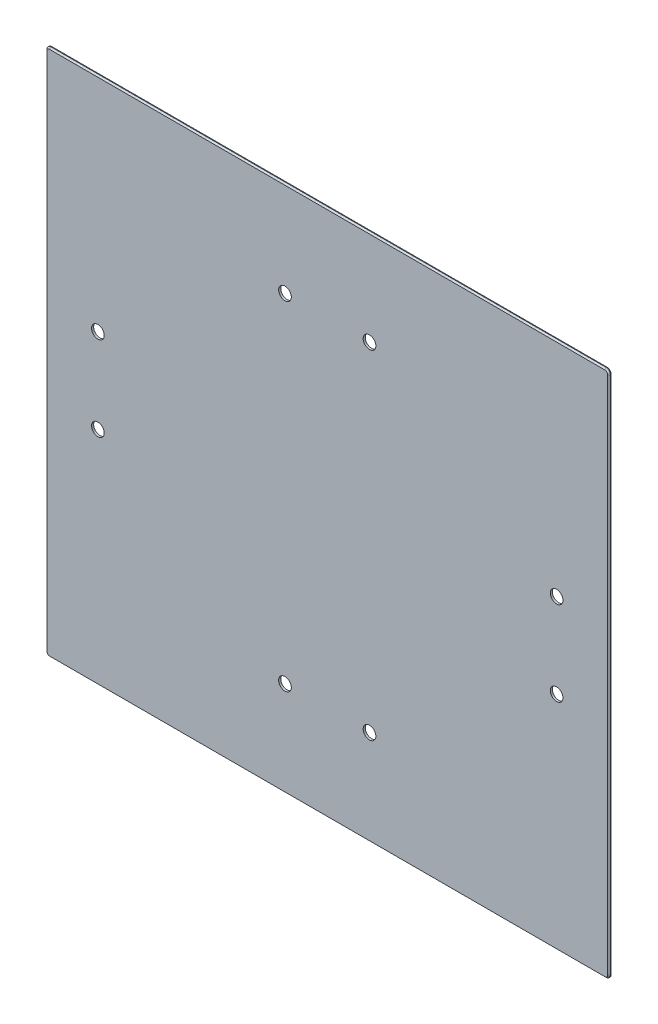
ISO-10303-21;
HEADER;
FILE_DESCRIPTION(('STEP AP214'),'2;1');
FILE_NAME('part.step','',(''),(''),'','','');
FILE_SCHEMA(('AUTOMOTIVE_DESIGN { 1 0 10303 214 1 1 1 1 }'));
ENDSEC;
DATA;
#1=APPLICATION_CONTEXT('core data for automotive mechanical design processes');
#2=APPLICATION_PROTOCOL_DEFINITION('international standard','automotive_design',2000,#1);
#3=PRODUCT_CONTEXT('',#1,'mechanical');
#4=PRODUCT('Part','Part','',(#3));
#5=PRODUCT_RELATED_PRODUCT_CATEGORY('part','',(#4));
#6=PRODUCT_DEFINITION_FORMATION('','',#4);
#7=PRODUCT_DEFINITION_CONTEXT('part definition',#1,'design');
#8=PRODUCT_DEFINITION('design','',#6,#7);
#9=PRODUCT_DEFINITION_SHAPE('','',#8);
#10=(LENGTH_UNIT() NAMED_UNIT(*) SI_UNIT(.MILLI.,.METRE.));
#11=(NAMED_UNIT(*) PLANE_ANGLE_UNIT() SI_UNIT($,.RADIAN.));
#12=(NAMED_UNIT(*) SI_UNIT($,.STERADIAN.) SOLID_ANGLE_UNIT());
#13=UNCERTAINTY_MEASURE_WITH_UNIT(LENGTH_MEASURE(1.E-05),#10,'distance_accuracy_value','');
#14=(GEOMETRIC_REPRESENTATION_CONTEXT(3) GLOBAL_UNCERTAINTY_ASSIGNED_CONTEXT((#13)) GLOBAL_UNIT_ASSIGNED_CONTEXT((#10,
#11,#12)) REPRESENTATION_CONTEXT('',''));
#15=CARTESIAN_POINT('',(0.,0.,0.));
#16=DIRECTION('',(0.,0.,1.));
#17=DIRECTION('',(1.,0.,0.));
#18=AXIS2_PLACEMENT_3D('',#15,#16,#17);
#19=CARTESIAN_POINT('',(200.,-187.5,1.5));
#20=DIRECTION('',(-1.,0.,0.));
#21=DIRECTION('',(0.,0.,1.));
#22=AXIS2_PLACEMENT_3D('',#19,#20,#21);
#23=PLANE('',#22);
#24=DIRECTION('',(0.,0.,-1.));
#25=VECTOR('',#24,1.);
#26=CARTESIAN_POINT('',(200.,184.5,1.5));
#27=LINE('',#26,#25);
#28=CARTESIAN_POINT('',(200.,184.5,0.));
#29=VERTEX_POINT('',#28);
#30=CARTESIAN_POINT('',(200.,184.5,0.500000000000055));
#31=VERTEX_POINT('',#30);
#32=EDGE_CURVE('E156',#29,#31,#27,.F.);
#33=ORIENTED_EDGE('',*,*,#32,.T.);
#34=DIRECTION('',(0.,-1.,0.));
#35=VECTOR('',#34,1.);
#36=CARTESIAN_POINT('',(200.,-187.5,0.500000000000055));
#37=LINE('',#36,#35);
#38=CARTESIAN_POINT('',(200.,-184.5,0.500000000000055));
#39=VERTEX_POINT('',#38);
#40=EDGE_CURVE('E190',#31,#39,#37,.T.);
#41=ORIENTED_EDGE('',*,*,#40,.T.);
#42=DIRECTION('',(0.,0.,-1.));
#43=VECTOR('',#42,1.);
#44=CARTESIAN_POINT('',(200.,-184.5,1.5));
#45=LINE('',#44,#43);
#46=CARTESIAN_POINT('',(200.,-184.5,0.));
#47=VERTEX_POINT('',#46);
#48=EDGE_CURVE('E159',#39,#47,#45,.T.);
#49=ORIENTED_EDGE('',*,*,#48,.T.);
#50=DIRECTION('',(0.,1.,0.));
#51=VECTOR('',#50,1.);
#52=CARTESIAN_POINT('',(200.,-187.5,0.));
#53=LINE('',#52,#51);
#54=EDGE_CURVE('E219',#47,#29,#53,.T.);
#55=ORIENTED_EDGE('',*,*,#54,.T.);
#56=EDGE_LOOP('',(#33,#41,#49,#55));
#57=FACE_BOUND('',#56,.T.);
#58=ADVANCED_FACE('F32',(#57),#23,.F.);
#59=CARTESIAN_POINT('',(-200.,187.5,1.5));
#60=DIRECTION('',(0.,-1.,0.));
#61=DIRECTION('',(0.,0.,-1.));
#62=AXIS2_PLACEMENT_3D('',#59,#60,#61);
#63=PLANE('',#62);
#64=DIRECTION('',(0.,0.,-1.));
#65=VECTOR('',#64,1.);
#66=CARTESIAN_POINT('',(-197.,187.5,1.5));
#67=LINE('',#66,#65);
#68=CARTESIAN_POINT('',(-197.,187.5,0.));
#69=VERTEX_POINT('',#68);
#70=CARTESIAN_POINT('',(-197.,187.5,0.500000000000055));
#71=VERTEX_POINT('',#70);
#72=EDGE_CURVE('E161',#69,#71,#67,.F.);
#73=ORIENTED_EDGE('',*,*,#72,.T.);
#74=DIRECTION('',(1.,0.,0.));
#75=VECTOR('',#74,1.);
#76=CARTESIAN_POINT('',(-200.,187.5,0.500000000000055));
#77=LINE('',#76,#75);
#78=CARTESIAN_POINT('',(197.,187.5,0.500000000000055));
#79=VERTEX_POINT('',#78);
#80=EDGE_CURVE('E186',#71,#79,#77,.T.);
#81=ORIENTED_EDGE('',*,*,#80,.T.);
#82=DIRECTION('',(0.,0.,-1.));
#83=VECTOR('',#82,1.);
#84=CARTESIAN_POINT('',(197.,187.5,1.5));
#85=LINE('',#84,#83);
#86=CARTESIAN_POINT('',(197.,187.5,0.));
#87=VERTEX_POINT('',#86);
#88=EDGE_CURVE('E164',#79,#87,#85,.T.);
#89=ORIENTED_EDGE('',*,*,#88,.T.);
#90=DIRECTION('',(-1.,0.,0.));
#91=VECTOR('',#90,1.);
#92=CARTESIAN_POINT('',(-200.,187.5,0.));
#93=LINE('',#92,#91);
#94=EDGE_CURVE('E146',#87,#69,#93,.T.);
#95=ORIENTED_EDGE('',*,*,#94,.T.);
#96=EDGE_LOOP('',(#73,#81,#89,#95));
#97=FACE_BOUND('',#96,.T.);
#98=ADVANCED_FACE('F272',(#97),#63,.F.);
#99=CARTESIAN_POINT('',(-200.,-187.5,1.5));
#100=DIRECTION('',(1.,0.,0.));
#101=DIRECTION('',(0.,0.,-1.));
#102=AXIS2_PLACEMENT_3D('',#99,#100,#101);
#103=PLANE('',#102);
#104=DIRECTION('',(0.,0.,-1.));
#105=VECTOR('',#104,1.);
#106=CARTESIAN_POINT('',(-200.,-184.5,1.5));
#107=LINE('',#106,#105);
#108=CARTESIAN_POINT('',(-200.,-184.5,0.));
#109=VERTEX_POINT('',#108);
#110=CARTESIAN_POINT('',(-200.,-184.5,0.500000000000055));
#111=VERTEX_POINT('',#110);
#112=EDGE_CURVE('E133',#109,#111,#107,.F.);
#113=ORIENTED_EDGE('',*,*,#112,.T.);
#114=DIRECTION('',(0.,1.,0.));
#115=VECTOR('',#114,1.);
#116=CARTESIAN_POINT('',(-200.,-187.5,0.500000000000055));
#117=LINE('',#116,#115);
#118=CARTESIAN_POINT('',(-200.,184.5,0.500000000000055));
#119=VERTEX_POINT('',#118);
#120=EDGE_CURVE('E11',#111,#119,#117,.T.);
#121=ORIENTED_EDGE('',*,*,#120,.T.);
#122=DIRECTION('',(0.,0.,-1.));
#123=VECTOR('',#122,1.);
#124=CARTESIAN_POINT('',(-200.,184.5,1.5));
#125=LINE('',#124,#123);
#126=CARTESIAN_POINT('',(-200.,184.5,0.));
#127=VERTEX_POINT('',#126);
#128=EDGE_CURVE('E137',#119,#127,#125,.T.);
#129=ORIENTED_EDGE('',*,*,#128,.T.);
#130=DIRECTION('',(0.,-1.,0.));
#131=VECTOR('',#130,1.);
#132=CARTESIAN_POINT('',(-200.,-187.5,0.));
#133=LINE('',#132,#131);
#134=EDGE_CURVE('E143',#127,#109,#133,.T.);
#135=ORIENTED_EDGE('',*,*,#134,.T.);
#136=EDGE_LOOP('',(#113,#121,#129,#135));
#137=FACE_BOUND('',#136,.T.);
#138=ADVANCED_FACE('F337',(#137),#103,.F.);
#139=CARTESIAN_POINT('',(-200.,-187.5,1.5));
#140=DIRECTION('',(0.,1.,0.));
#141=DIRECTION('',(0.,0.,1.));
#142=AXIS2_PLACEMENT_3D('',#139,#140,#141);
#143=PLANE('',#142);
#144=DIRECTION('',(0.,0.,-1.));
#145=VECTOR('',#144,1.);
#146=CARTESIAN_POINT('',(197.,-187.5,1.5));
#147=LINE('',#146,#145);
#148=CARTESIAN_POINT('',(197.,-187.5,0.));
#149=VERTEX_POINT('',#148);
#150=CARTESIAN_POINT('',(197.,-187.5,0.500000000000055));
#151=VERTEX_POINT('',#150);
#152=EDGE_CURVE('E129',#149,#151,#147,.F.);
#153=ORIENTED_EDGE('',*,*,#152,.T.);
#154=DIRECTION('',(-1.,0.,0.));
#155=VECTOR('',#154,1.);
#156=CARTESIAN_POINT('',(-200.,-187.5,0.500000000000055));
#157=LINE('',#156,#155);
#158=CARTESIAN_POINT('',(-197.,-187.5,0.500000000000055));
#159=VERTEX_POINT('',#158);
#160=EDGE_CURVE('E56',#151,#159,#157,.T.);
#161=ORIENTED_EDGE('',*,*,#160,.T.);
#162=DIRECTION('',(0.,0.,-1.));
#163=VECTOR('',#162,1.);
#164=CARTESIAN_POINT('',(-197.,-187.5,1.5));
#165=LINE('',#164,#163);
#166=CARTESIAN_POINT('',(-197.,-187.5,0.));
#167=VERTEX_POINT('',#166);
#168=EDGE_CURVE('E121',#159,#167,#165,.T.);
#169=ORIENTED_EDGE('',*,*,#168,.T.);
#170=DIRECTION('',(1.,0.,0.));
#171=VECTOR('',#170,1.);
#172=CARTESIAN_POINT('',(-200.,-187.5,0.));
#173=LINE('',#172,#171);
#174=EDGE_CURVE('E125',#167,#149,#173,.T.);
#175=ORIENTED_EDGE('',*,*,#174,.T.);
#176=EDGE_LOOP('',(#153,#161,#169,#175));
#177=FACE_BOUND('',#176,.T.);
#178=ADVANCED_FACE('F123',(#177),#143,.F.);
#179=CARTESIAN_POINT('',(0.,0.,1.5));
#180=DIRECTION('',(0.,0.,-1.));
#181=DIRECTION('',(-1.,0.,0.));
#182=AXIS2_PLACEMENT_3D('',#179,#180,#181);
#183=PLANE('',#182);
#184=CARTESIAN_POINT('',(30.,120.,1.5));
#185=DIRECTION('',(0.,0.,1.));
#186=DIRECTION('',(1.,0.,0.));
#187=AXIS2_PLACEMENT_3D('',#184,#185,#186);
#188=CIRCLE('',#187,4.49999999999242);
#189=CARTESIAN_POINT('',(34.4999999999924,120.,1.5));
#190=VERTEX_POINT('',#189);
#191=EDGE_CURVE('E254',#190,#190,#188,.T.);
#192=ORIENTED_EDGE('',*,*,#191,.F.);
#193=EDGE_LOOP('',(#192));
#194=FACE_BOUND('',#193,.T.);
#195=CARTESIAN_POINT('',(162.800000000023,30.,1.5));
#196=DIRECTION('',(0.,0.,1.));
#197=DIRECTION('',(1.,0.,0.));
#198=AXIS2_PLACEMENT_3D('',#195,#196,#197);
#199=CIRCLE('',#198,4.49999999999999);
#200=CARTESIAN_POINT('',(167.300000000023,30.,1.5));
#201=VERTEX_POINT('',#200);
#202=EDGE_CURVE('E244',#201,#201,#199,.T.);
#203=ORIENTED_EDGE('',*,*,#202,.F.);
#204=EDGE_LOOP('',(#203));
#205=FACE_BOUND('',#204,.T.);
#206=CARTESIAN_POINT('',(162.800000000014,-30.,1.5));
#207=DIRECTION('',(0.,0.,1.));
#208=DIRECTION('',(1.,0.,0.));
#209=AXIS2_PLACEMENT_3D('',#206,#207,#208);
#210=CIRCLE('',#209,4.49999999999999);
#211=CARTESIAN_POINT('',(167.300000000014,-30.,1.5));
#212=VERTEX_POINT('',#211);
#213=EDGE_CURVE('E241',#212,#212,#210,.T.);
#214=ORIENTED_EDGE('',*,*,#213,.F.);
#215=EDGE_LOOP('',(#214));
#216=FACE_BOUND('',#215,.T.);
#217=CARTESIAN_POINT('',(30.,-120.,1.5));
#218=DIRECTION('',(0.,0.,1.));
#219=DIRECTION('',(1.,0.,0.));
#220=AXIS2_PLACEMENT_3D('',#217,#218,#219);
#221=CIRCLE('',#220,4.50000000000001);
#222=CARTESIAN_POINT('',(34.5,-120.,1.5));
#223=VERTEX_POINT('',#222);
#224=EDGE_CURVE('E238',#223,#223,#221,.T.);
#225=ORIENTED_EDGE('',*,*,#224,.F.);
#226=EDGE_LOOP('',(#225));
#227=FACE_BOUND('',#226,.T.);
#228=CARTESIAN_POINT('',(-29.9999999999999,-120.,1.5));
#229=DIRECTION('',(0.,0.,1.));
#230=DIRECTION('',(1.,0.,0.));
#231=AXIS2_PLACEMENT_3D('',#228,#229,#230);
#232=CIRCLE('',#231,4.49999999999237);
#233=CARTESIAN_POINT('',(-25.5000000000076,-120.,1.5));
#234=VERTEX_POINT('',#233);
#235=EDGE_CURVE('E234',#234,#234,#232,.T.);
#236=ORIENTED_EDGE('',*,*,#235,.F.);
#237=EDGE_LOOP('',(#236));
#238=FACE_BOUND('',#237,.T.);
#239=CARTESIAN_POINT('',(-162.799999999996,-30.,1.5));
#240=DIRECTION('',(0.,0.,1.));
#241=DIRECTION('',(1.,0.,0.));
#242=AXIS2_PLACEMENT_3D('',#239,#240,#241);
#243=CIRCLE('',#242,4.49999999999517);
#244=CARTESIAN_POINT('',(-158.3,-30.,1.5));
#245=VERTEX_POINT('',#244);
#246=EDGE_CURVE('E230',#245,#245,#243,.T.);
#247=ORIENTED_EDGE('',*,*,#246,.F.);
#248=EDGE_LOOP('',(#247));
#249=FACE_BOUND('',#248,.T.);
#250=CARTESIAN_POINT('',(-162.799999999996,30.,1.5));
#251=DIRECTION('',(0.,0.,1.));
#252=DIRECTION('',(1.,0.,0.));
#253=AXIS2_PLACEMENT_3D('',#250,#251,#252);
#254=CIRCLE('',#253,4.49999999999999);
#255=CARTESIAN_POINT('',(-158.299999999996,30.,1.5));
#256=VERTEX_POINT('',#255);
#257=EDGE_CURVE('E226',#256,#256,#254,.T.);
#258=ORIENTED_EDGE('',*,*,#257,.F.);
#259=EDGE_LOOP('',(#258));
#260=FACE_BOUND('',#259,.T.);
#261=CARTESIAN_POINT('',(-30.,120.,1.5));
#262=DIRECTION('',(0.,0.,1.));
#263=DIRECTION('',(1.,0.,0.));
#264=AXIS2_PLACEMENT_3D('',#261,#262,#263);
#265=CIRCLE('',#264,4.49999999999237);
#266=CARTESIAN_POINT('',(-25.5000000000076,120.,1.5));
#267=VERTEX_POINT('',#266);
#268=EDGE_CURVE('E222',#267,#267,#265,.T.);
#269=ORIENTED_EDGE('',*,*,#268,.F.);
#270=EDGE_LOOP('',(#269));
#271=FACE_BOUND('',#270,.T.);
#272=DIRECTION('',(-1.,0.,0.));
#273=VECTOR('',#272,1.);
#274=CARTESIAN_POINT('',(0.,186.5,1.5));
#275=LINE('',#274,#273);
#276=CARTESIAN_POINT('',(197.,186.5,1.5));
#277=VERTEX_POINT('',#276);
#278=CARTESIAN_POINT('',(-197.,186.5,1.5));
#279=VERTEX_POINT('',#278);
#280=EDGE_CURVE('E178',#277,#279,#275,.T.);
#281=ORIENTED_EDGE('',*,*,#280,.T.);
#282=CARTESIAN_POINT('',(-197.,184.5,1.5));
#283=DIRECTION('',(0.,0.,-1.));
#284=DIRECTION('',(-1.,0.,0.));
#285=AXIS2_PLACEMENT_3D('',#282,#283,#284);
#286=CIRCLE('',#285,2.);
#287=CARTESIAN_POINT('',(-199.,184.5,1.5));
#288=VERTEX_POINT('',#287);
#289=EDGE_CURVE('E180',#279,#288,#286,.F.);
#290=ORIENTED_EDGE('',*,*,#289,.T.);
#291=DIRECTION('',(0.,-1.,0.));
#292=VECTOR('',#291,1.);
#293=CARTESIAN_POINT('',(-199.,0.,1.5));
#294=LINE('',#293,#292);
#295=CARTESIAN_POINT('',(-199.,-184.5,1.5));
#296=VERTEX_POINT('',#295);
#297=EDGE_CURVE('E166',#288,#296,#294,.T.);
#298=ORIENTED_EDGE('',*,*,#297,.T.);
#299=CARTESIAN_POINT('',(-197.,-184.5,1.5));
#300=DIRECTION('',(0.,0.,-1.));
#301=DIRECTION('',(-1.,0.,0.));
#302=AXIS2_PLACEMENT_3D('',#299,#300,#301);
#303=CIRCLE('',#302,2.);
#304=CARTESIAN_POINT('',(-197.,-186.5,1.5));
#305=VERTEX_POINT('',#304);
#306=EDGE_CURVE('E168',#296,#305,#303,.F.);
#307=ORIENTED_EDGE('',*,*,#306,.T.);
#308=DIRECTION('',(1.,0.,0.));
#309=VECTOR('',#308,1.);
#310=CARTESIAN_POINT('',(0.,-186.5,1.5));
#311=LINE('',#310,#309);
#312=CARTESIAN_POINT('',(197.,-186.5,1.5));
#313=VERTEX_POINT('',#312);
#314=EDGE_CURVE('E170',#305,#313,#311,.T.);
#315=ORIENTED_EDGE('',*,*,#314,.T.);
#316=CARTESIAN_POINT('',(197.,-184.5,1.5));
#317=DIRECTION('',(0.,0.,-1.));
#318=DIRECTION('',(-1.,0.,0.));
#319=AXIS2_PLACEMENT_3D('',#316,#317,#318);
#320=CIRCLE('',#319,2.);
#321=CARTESIAN_POINT('',(199.,-184.5,1.5));
#322=VERTEX_POINT('',#321);
#323=EDGE_CURVE('E172',#313,#322,#320,.F.);
#324=ORIENTED_EDGE('',*,*,#323,.T.);
#325=DIRECTION('',(0.,1.,0.));
#326=VECTOR('',#325,1.);
#327=CARTESIAN_POINT('',(199.,0.,1.5));
#328=LINE('',#327,#326);
#329=CARTESIAN_POINT('',(199.,184.5,1.5));
#330=VERTEX_POINT('',#329);
#331=EDGE_CURVE('E174',#322,#330,#328,.T.);
#332=ORIENTED_EDGE('',*,*,#331,.T.);
#333=CARTESIAN_POINT('',(197.,184.5,1.5));
#334=DIRECTION('',(0.,0.,-1.));
#335=DIRECTION('',(-1.,0.,0.));
#336=AXIS2_PLACEMENT_3D('',#333,#334,#335);
#337=CIRCLE('',#336,2.);
#338=EDGE_CURVE('E176',#330,#277,#337,.F.);
#339=ORIENTED_EDGE('',*,*,#338,.T.);
#340=EDGE_LOOP('',(#281,#290,#298,#307,#315,#324,#332,#339));
#341=FACE_BOUND('',#340,.T.);
#342=ADVANCED_FACE('F293',(#194,#205,#216,#227,#238,#249,#260,#271,#341),#183,.F.);
#343=CARTESIAN_POINT('',(0.,0.,0.));
#344=DIRECTION('',(0.,0.,-1.));
#345=DIRECTION('',(-1.,0.,0.));
#346=AXIS2_PLACEMENT_3D('',#343,#344,#345);
#347=PLANE('',#346);
#348=CARTESIAN_POINT('',(30.,120.,0.));
#349=DIRECTION('',(0.,0.,-1.));
#350=DIRECTION('',(-1.,0.,0.));
#351=AXIS2_PLACEMENT_3D('',#348,#349,#350);
#352=CIRCLE('',#351,4.49999999999242);
#353=CARTESIAN_POINT('',(25.5000000000076,120.,0.));
#354=VERTEX_POINT('',#353);
#355=EDGE_CURVE('E36',#354,#354,#352,.T.);
#356=ORIENTED_EDGE('',*,*,#355,.F.);
#357=EDGE_LOOP('',(#356));
#358=FACE_BOUND('',#357,.T.);
#359=CARTESIAN_POINT('',(162.800000000023,30.,0.));
#360=DIRECTION('',(0.,0.,-1.));
#361=DIRECTION('',(-1.,0.,0.));
#362=AXIS2_PLACEMENT_3D('',#359,#360,#361);
#363=CIRCLE('',#362,4.49999999999999);
#364=CARTESIAN_POINT('',(158.300000000023,30.,0.));
#365=VERTEX_POINT('',#364);
#366=EDGE_CURVE('E242',#365,#365,#363,.T.);
#367=ORIENTED_EDGE('',*,*,#366,.F.);
#368=EDGE_LOOP('',(#367));
#369=FACE_BOUND('',#368,.T.);
#370=CARTESIAN_POINT('',(162.800000000014,-30.,0.));
#371=DIRECTION('',(0.,0.,-1.));
#372=DIRECTION('',(-1.,0.,0.));
#373=AXIS2_PLACEMENT_3D('',#370,#371,#372);
#374=CIRCLE('',#373,4.49999999999999);
#375=CARTESIAN_POINT('',(158.300000000014,-30.,0.));
#376=VERTEX_POINT('',#375);
#377=EDGE_CURVE('E239',#376,#376,#374,.T.);
#378=ORIENTED_EDGE('',*,*,#377,.F.);
#379=EDGE_LOOP('',(#378));
#380=FACE_BOUND('',#379,.T.);
#381=CARTESIAN_POINT('',(30.,-120.,0.));
#382=DIRECTION('',(0.,0.,-1.));
#383=DIRECTION('',(-1.,0.,0.));
#384=AXIS2_PLACEMENT_3D('',#381,#382,#383);
#385=CIRCLE('',#384,4.50000000000001);
#386=CARTESIAN_POINT('',(25.5,-120.,0.));
#387=VERTEX_POINT('',#386);
#388=EDGE_CURVE('E235',#387,#387,#385,.T.);
#389=ORIENTED_EDGE('',*,*,#388,.F.);
#390=EDGE_LOOP('',(#389));
#391=FACE_BOUND('',#390,.T.);
#392=CARTESIAN_POINT('',(-29.9999999999999,-120.,0.));
#393=DIRECTION('',(0.,0.,-1.));
#394=DIRECTION('',(-1.,0.,0.));
#395=AXIS2_PLACEMENT_3D('',#392,#393,#394);
#396=CIRCLE('',#395,4.49999999999237);
#397=CARTESIAN_POINT('',(-34.4999999999923,-120.,0.));
#398=VERTEX_POINT('',#397);
#399=EDGE_CURVE('E231',#398,#398,#396,.T.);
#400=ORIENTED_EDGE('',*,*,#399,.F.);
#401=EDGE_LOOP('',(#400));
#402=FACE_BOUND('',#401,.T.);
#403=CARTESIAN_POINT('',(-162.799999999996,-30.,0.));
#404=DIRECTION('',(0.,0.,-1.));
#405=DIRECTION('',(-1.,0.,0.));
#406=AXIS2_PLACEMENT_3D('',#403,#404,#405);
#407=CIRCLE('',#406,4.49999999999517);
#408=CARTESIAN_POINT('',(-167.299999999991,-30.,0.));
#409=VERTEX_POINT('',#408);
#410=EDGE_CURVE('E227',#409,#409,#407,.T.);
#411=ORIENTED_EDGE('',*,*,#410,.F.);
#412=EDGE_LOOP('',(#411));
#413=FACE_BOUND('',#412,.T.);
#414=CARTESIAN_POINT('',(-162.799999999996,30.,0.));
#415=DIRECTION('',(0.,0.,-1.));
#416=DIRECTION('',(-1.,0.,0.));
#417=AXIS2_PLACEMENT_3D('',#414,#415,#416);
#418=CIRCLE('',#417,4.49999999999999);
#419=CARTESIAN_POINT('',(-167.299999999996,30.,0.));
#420=VERTEX_POINT('',#419);
#421=EDGE_CURVE('E223',#420,#420,#418,.T.);
#422=ORIENTED_EDGE('',*,*,#421,.F.);
#423=EDGE_LOOP('',(#422));
#424=FACE_BOUND('',#423,.T.);
#425=CARTESIAN_POINT('',(-30.,120.,0.));
#426=DIRECTION('',(0.,0.,-1.));
#427=DIRECTION('',(-1.,0.,0.));
#428=AXIS2_PLACEMENT_3D('',#425,#426,#427);
#429=CIRCLE('',#428,4.49999999999237);
#430=CARTESIAN_POINT('',(-34.4999999999924,120.,0.));
#431=VERTEX_POINT('',#430);
#432=EDGE_CURVE('E199',#431,#431,#429,.T.);
#433=ORIENTED_EDGE('',*,*,#432,.F.);
#434=EDGE_LOOP('',(#433));
#435=FACE_BOUND('',#434,.T.);
#436=ORIENTED_EDGE('',*,*,#174,.F.);
#437=CARTESIAN_POINT('',(-197.,-184.5,0.));
#438=DIRECTION('',(0.,0.,-1.));
#439=DIRECTION('',(-1.,0.,0.));
#440=AXIS2_PLACEMENT_3D('',#437,#438,#439);
#441=CIRCLE('',#440,3.);
#442=EDGE_CURVE('E131',#167,#109,#441,.T.);
#443=ORIENTED_EDGE('',*,*,#442,.T.);
#444=ORIENTED_EDGE('',*,*,#134,.F.);
#445=CARTESIAN_POINT('',(-197.,184.5,0.));
#446=DIRECTION('',(0.,0.,-1.));
#447=DIRECTION('',(-1.,0.,0.));
#448=AXIS2_PLACEMENT_3D('',#445,#446,#447);
#449=CIRCLE('',#448,3.);
#450=EDGE_CURVE('E128',#127,#69,#449,.T.);
#451=ORIENTED_EDGE('',*,*,#450,.T.);
#452=ORIENTED_EDGE('',*,*,#94,.F.);
#453=CARTESIAN_POINT('',(197.,184.5,0.));
#454=DIRECTION('',(0.,0.,-1.));
#455=DIRECTION('',(-1.,0.,0.));
#456=AXIS2_PLACEMENT_3D('',#453,#454,#455);
#457=CIRCLE('',#456,3.);
#458=EDGE_CURVE('E151',#87,#29,#457,.T.);
#459=ORIENTED_EDGE('',*,*,#458,.T.);
#460=ORIENTED_EDGE('',*,*,#54,.F.);
#461=CARTESIAN_POINT('',(197.,-184.5,0.));
#462=DIRECTION('',(0.,0.,-1.));
#463=DIRECTION('',(-1.,0.,0.));
#464=AXIS2_PLACEMENT_3D('',#461,#462,#463);
#465=CIRCLE('',#464,3.);
#466=EDGE_CURVE('E138',#47,#149,#465,.T.);
#467=ORIENTED_EDGE('',*,*,#466,.T.);
#468=EDGE_LOOP('',(#436,#443,#444,#451,#452,#459,#460,#467));
#469=FACE_BOUND('',#468,.T.);
#470=ADVANCED_FACE('F140',(#358,#369,#380,#391,#402,#413,#424,#435,#469),#347,.T.);
#471=CARTESIAN_POINT('',(-197.,-184.5,1.5));
#472=DIRECTION('',(0.,0.,-1.));
#473=DIRECTION('',(-1.,0.,0.));
#474=AXIS2_PLACEMENT_3D('',#471,#472,#473);
#475=CYLINDRICAL_SURFACE('',#474,3.);
#476=ORIENTED_EDGE('',*,*,#168,.F.);
#477=CARTESIAN_POINT('',(-197.,-184.5,0.500000000000055));
#478=DIRECTION('',(0.,0.,-1.));
#479=DIRECTION('',(-1.,0.,0.));
#480=AXIS2_PLACEMENT_3D('',#477,#478,#479);
#481=CIRCLE('',#480,3.);
#482=EDGE_CURVE('E41',#159,#111,#481,.T.);
#483=ORIENTED_EDGE('',*,*,#482,.T.);
#484=ORIENTED_EDGE('',*,*,#112,.F.);
#485=ORIENTED_EDGE('',*,*,#442,.F.);
#486=EDGE_LOOP('',(#476,#483,#484,#485));
#487=FACE_BOUND('',#486,.T.);
#488=ADVANCED_FACE('F132',(#487),#475,.T.);
#489=CARTESIAN_POINT('',(197.,-184.5,1.5));
#490=DIRECTION('',(0.,0.,-1.));
#491=DIRECTION('',(-1.,0.,0.));
#492=AXIS2_PLACEMENT_3D('',#489,#490,#491);
#493=CYLINDRICAL_SURFACE('',#492,3.);
#494=ORIENTED_EDGE('',*,*,#48,.F.);
#495=CARTESIAN_POINT('',(197.,-184.5,0.500000000000055));
#496=DIRECTION('',(0.,0.,-1.));
#497=DIRECTION('',(-1.,0.,0.));
#498=AXIS2_PLACEMENT_3D('',#495,#496,#497);
#499=CIRCLE('',#498,3.);
#500=EDGE_CURVE('E192',#39,#151,#499,.T.);
#501=ORIENTED_EDGE('',*,*,#500,.T.);
#502=ORIENTED_EDGE('',*,*,#152,.F.);
#503=ORIENTED_EDGE('',*,*,#466,.F.);
#504=EDGE_LOOP('',(#494,#501,#502,#503));
#505=FACE_BOUND('',#504,.T.);
#506=ADVANCED_FACE('F315',(#505),#493,.T.);
#507=CARTESIAN_POINT('',(197.,184.5,1.5));
#508=DIRECTION('',(0.,0.,-1.));
#509=DIRECTION('',(-1.,0.,0.));
#510=AXIS2_PLACEMENT_3D('',#507,#508,#509);
#511=CYLINDRICAL_SURFACE('',#510,3.);
#512=ORIENTED_EDGE('',*,*,#88,.F.);
#513=CARTESIAN_POINT('',(197.,184.5,0.500000000000055));
#514=DIRECTION('',(0.,0.,-1.));
#515=DIRECTION('',(-1.,0.,0.));
#516=AXIS2_PLACEMENT_3D('',#513,#514,#515);
#517=CIRCLE('',#516,3.);
#518=EDGE_CURVE('E188',#79,#31,#517,.T.);
#519=ORIENTED_EDGE('',*,*,#518,.T.);
#520=ORIENTED_EDGE('',*,*,#32,.F.);
#521=ORIENTED_EDGE('',*,*,#458,.F.);
#522=EDGE_LOOP('',(#512,#519,#520,#521));
#523=FACE_BOUND('',#522,.T.);
#524=ADVANCED_FACE('F301',(#523),#511,.T.);
#525=CARTESIAN_POINT('',(-197.,184.5,1.5));
#526=DIRECTION('',(0.,0.,-1.));
#527=DIRECTION('',(-1.,0.,0.));
#528=AXIS2_PLACEMENT_3D('',#525,#526,#527);
#529=CYLINDRICAL_SURFACE('',#528,3.);
#530=ORIENTED_EDGE('',*,*,#128,.F.);
#531=CARTESIAN_POINT('',(-197.,184.5,0.500000000000055));
#532=DIRECTION('',(0.,0.,-1.));
#533=DIRECTION('',(-1.,0.,0.));
#534=AXIS2_PLACEMENT_3D('',#531,#532,#533);
#535=CIRCLE('',#534,3.);
#536=EDGE_CURVE('E183',#119,#71,#535,.T.);
#537=ORIENTED_EDGE('',*,*,#536,.T.);
#538=ORIENTED_EDGE('',*,*,#72,.F.);
#539=ORIENTED_EDGE('',*,*,#450,.F.);
#540=EDGE_LOOP('',(#530,#537,#538,#539));
#541=FACE_BOUND('',#540,.T.);
#542=ADVANCED_FACE('F278',(#541),#529,.T.);
#543=CARTESIAN_POINT('',(197.,-184.5,1.5));
#544=DIRECTION('',(0.,0.,-1.));
#545=DIRECTION('',(-1.,0.,0.));
#546=AXIS2_PLACEMENT_3D('',#543,#544,#545);
#547=CONICAL_SURFACE('',#546,2.,0.785398163397475);
#548=DIRECTION('',(0.,0.707106781186567,0.707106781186528));
#549=VECTOR('',#548,1.);
#550=CARTESIAN_POINT('',(197.,-187.5,0.500000000000055));
#551=LINE('',#550,#549);
#552=EDGE_CURVE('E213',#151,#313,#551,.T.);
#553=ORIENTED_EDGE('',*,*,#552,.F.);
#554=ORIENTED_EDGE('',*,*,#500,.F.);
#555=DIRECTION('',(0.707106781186567,0.,-0.707106781186528));
#556=VECTOR('',#555,1.);
#557=CARTESIAN_POINT('',(199.,-184.5,1.5));
#558=LINE('',#557,#556);
#559=EDGE_CURVE('E216',#322,#39,#558,.T.);
#560=ORIENTED_EDGE('',*,*,#559,.F.);
#561=ORIENTED_EDGE('',*,*,#323,.F.);
#562=EDGE_LOOP('',(#553,#554,#560,#561));
#563=FACE_BOUND('',#562,.T.);
#564=ADVANCED_FACE('F34',(#563),#547,.T.);
#565=CARTESIAN_POINT('',(199.,0.,1.5));
#566=DIRECTION('',(-0.707106781186528,0.,-0.707106781186567));
#567=DIRECTION('',(0.,1.,0.));
#568=AXIS2_PLACEMENT_3D('',#565,#566,#567);
#569=PLANE('',#568);
#570=ORIENTED_EDGE('',*,*,#559,.T.);
#571=ORIENTED_EDGE('',*,*,#40,.F.);
#572=DIRECTION('',(0.707106781186567,0.,-0.707106781186528));
#573=VECTOR('',#572,1.);
#574=CARTESIAN_POINT('',(199.,184.5,1.5));
#575=LINE('',#574,#573);
#576=EDGE_CURVE('E210',#330,#31,#575,.T.);
#577=ORIENTED_EDGE('',*,*,#576,.F.);
#578=ORIENTED_EDGE('',*,*,#331,.F.);
#579=EDGE_LOOP('',(#570,#571,#577,#578));
#580=FACE_BOUND('',#579,.T.);
#581=ADVANCED_FACE('F309',(#580),#569,.F.);
#582=CARTESIAN_POINT('',(0.,-186.5,1.5));
#583=DIRECTION('',(0.,0.707106781186528,-0.707106781186567));
#584=DIRECTION('',(1.,0.,0.));
#585=AXIS2_PLACEMENT_3D('',#582,#583,#584);
#586=PLANE('',#585);
#587=ORIENTED_EDGE('',*,*,#552,.T.);
#588=ORIENTED_EDGE('',*,*,#314,.F.);
#589=DIRECTION('',(0.,0.707106781186567,0.707106781186528));
#590=VECTOR('',#589,1.);
#591=CARTESIAN_POINT('',(-197.,-187.5,0.500000000000055));
#592=LINE('',#591,#590);
#593=EDGE_CURVE('E207',#159,#305,#592,.T.);
#594=ORIENTED_EDGE('',*,*,#593,.F.);
#595=ORIENTED_EDGE('',*,*,#160,.F.);
#596=EDGE_LOOP('',(#587,#588,#594,#595));
#597=FACE_BOUND('',#596,.T.);
#598=ADVANCED_FACE('F321',(#597),#586,.F.);
#599=CARTESIAN_POINT('',(197.,184.5,1.5));
#600=DIRECTION('',(0.,0.,-1.));
#601=DIRECTION('',(-1.,0.,0.));
#602=AXIS2_PLACEMENT_3D('',#599,#600,#601);
#603=CONICAL_SURFACE('',#602,2.,0.785398163397475);
#604=ORIENTED_EDGE('',*,*,#576,.T.);
#605=ORIENTED_EDGE('',*,*,#518,.F.);
#606=DIRECTION('',(0.,0.707106781186567,-0.707106781186528));
#607=VECTOR('',#606,1.);
#608=CARTESIAN_POINT('',(197.,186.5,1.5));
#609=LINE('',#608,#607);
#610=EDGE_CURVE('E204',#277,#79,#609,.T.);
#611=ORIENTED_EDGE('',*,*,#610,.F.);
#612=ORIENTED_EDGE('',*,*,#338,.F.);
#613=EDGE_LOOP('',(#604,#605,#611,#612));
#614=FACE_BOUND('',#613,.T.);
#615=ADVANCED_FACE('F304',(#614),#603,.T.);
#616=CARTESIAN_POINT('',(-197.,-184.5,1.5));
#617=DIRECTION('',(0.,0.,-1.));
#618=DIRECTION('',(-1.,0.,0.));
#619=AXIS2_PLACEMENT_3D('',#616,#617,#618);
#620=CONICAL_SURFACE('',#619,2.,0.785398163397475);
#621=ORIENTED_EDGE('',*,*,#593,.T.);
#622=ORIENTED_EDGE('',*,*,#306,.F.);
#623=DIRECTION('',(0.707106781186567,0.,0.707106781186528));
#624=VECTOR('',#623,1.);
#625=CARTESIAN_POINT('',(-200.,-184.5,0.500000000000055));
#626=LINE('',#625,#624);
#627=EDGE_CURVE('E201',#111,#296,#626,.T.);
#628=ORIENTED_EDGE('',*,*,#627,.F.);
#629=ORIENTED_EDGE('',*,*,#482,.F.);
#630=EDGE_LOOP('',(#621,#622,#628,#629));
#631=FACE_BOUND('',#630,.T.);
#632=ADVANCED_FACE('F323',(#631),#620,.T.);
#633=CARTESIAN_POINT('',(0.,186.5,1.5));
#634=DIRECTION('',(0.,-0.707106781186528,-0.707106781186567));
#635=DIRECTION('',(-1.,0.,0.));
#636=AXIS2_PLACEMENT_3D('',#633,#634,#635);
#637=PLANE('',#636);
#638=ORIENTED_EDGE('',*,*,#610,.T.);
#639=ORIENTED_EDGE('',*,*,#80,.F.);
#640=DIRECTION('',(0.,0.707106781186567,-0.707106781186528));
#641=VECTOR('',#640,1.);
#642=CARTESIAN_POINT('',(-197.,186.5,1.5));
#643=LINE('',#642,#641);
#644=EDGE_CURVE('E198',#279,#71,#643,.T.);
#645=ORIENTED_EDGE('',*,*,#644,.F.);
#646=ORIENTED_EDGE('',*,*,#280,.F.);
#647=EDGE_LOOP('',(#638,#639,#645,#646));
#648=FACE_BOUND('',#647,.T.);
#649=ADVANCED_FACE('F298',(#648),#637,.F.);
#650=CARTESIAN_POINT('',(-199.,0.,1.5));
#651=DIRECTION('',(0.707106781186528,0.,-0.707106781186567));
#652=DIRECTION('',(0.,-1.,0.));
#653=AXIS2_PLACEMENT_3D('',#650,#651,#652);
#654=PLANE('',#653);
#655=ORIENTED_EDGE('',*,*,#627,.T.);
#656=ORIENTED_EDGE('',*,*,#297,.F.);
#657=DIRECTION('',(0.707106781186567,0.,0.707106781186528));
#658=VECTOR('',#657,1.);
#659=CARTESIAN_POINT('',(-200.,184.5,0.500000000000055));
#660=LINE('',#659,#658);
#661=EDGE_CURVE('E196',#119,#288,#660,.T.);
#662=ORIENTED_EDGE('',*,*,#661,.F.);
#663=ORIENTED_EDGE('',*,*,#120,.F.);
#664=EDGE_LOOP('',(#655,#656,#662,#663));
#665=FACE_BOUND('',#664,.T.);
#666=ADVANCED_FACE('F289',(#665),#654,.F.);
#667=CARTESIAN_POINT('',(-197.,184.5,1.5));
#668=DIRECTION('',(0.,0.,-1.));
#669=DIRECTION('',(-1.,0.,0.));
#670=AXIS2_PLACEMENT_3D('',#667,#668,#669);
#671=CONICAL_SURFACE('',#670,2.,0.785398163397475);
#672=ORIENTED_EDGE('',*,*,#644,.T.);
#673=ORIENTED_EDGE('',*,*,#536,.F.);
#674=ORIENTED_EDGE('',*,*,#661,.T.);
#675=ORIENTED_EDGE('',*,*,#289,.F.);
#676=EDGE_LOOP('',(#672,#673,#674,#675));
#677=FACE_BOUND('',#676,.T.);
#678=ADVANCED_FACE('F282',(#677),#671,.T.);
#679=CARTESIAN_POINT('',(-30.,120.,-8.5));
#680=DIRECTION('',(0.,0.,1.));
#681=DIRECTION('',(1.,0.,0.));
#682=AXIS2_PLACEMENT_3D('',#679,#680,#681);
#683=CYLINDRICAL_SURFACE('',#682,4.49999999999237);
#684=ORIENTED_EDGE('',*,*,#432,.T.);
#685=EDGE_LOOP('',(#684));
#686=FACE_BOUND('',#685,.T.);
#687=ORIENTED_EDGE('',*,*,#268,.T.);
#688=EDGE_LOOP('',(#687));
#689=FACE_BOUND('',#688,.T.);
#690=ADVANCED_FACE('F351',(#686,#689),#683,.F.);
#691=CARTESIAN_POINT('',(-162.799999999996,30.,-8.5));
#692=DIRECTION('',(0.,0.,1.));
#693=DIRECTION('',(1.,0.,0.));
#694=AXIS2_PLACEMENT_3D('',#691,#692,#693);
#695=CYLINDRICAL_SURFACE('',#694,4.49999999999999);
#696=ORIENTED_EDGE('',*,*,#421,.T.);
#697=EDGE_LOOP('',(#696));
#698=FACE_BOUND('',#697,.T.);
#699=ORIENTED_EDGE('',*,*,#257,.T.);
#700=EDGE_LOOP('',(#699));
#701=FACE_BOUND('',#700,.T.);
#702=ADVANCED_FACE('F368',(#698,#701),#695,.F.);
#703=CARTESIAN_POINT('',(-162.799999999996,-30.,-8.5));
#704=DIRECTION('',(0.,0.,1.));
#705=DIRECTION('',(1.,0.,0.));
#706=AXIS2_PLACEMENT_3D('',#703,#704,#705);
#707=CYLINDRICAL_SURFACE('',#706,4.49999999999517);
#708=ORIENTED_EDGE('',*,*,#410,.T.);
#709=EDGE_LOOP('',(#708));
#710=FACE_BOUND('',#709,.T.);
#711=ORIENTED_EDGE('',*,*,#246,.T.);
#712=EDGE_LOOP('',(#711));
#713=FACE_BOUND('',#712,.T.);
#714=ADVANCED_FACE('F377',(#710,#713),#707,.F.);
#715=CARTESIAN_POINT('',(-29.9999999999999,-120.,-8.5));
#716=DIRECTION('',(0.,0.,1.));
#717=DIRECTION('',(1.,0.,0.));
#718=AXIS2_PLACEMENT_3D('',#715,#716,#717);
#719=CYLINDRICAL_SURFACE('',#718,4.49999999999237);
#720=ORIENTED_EDGE('',*,*,#399,.T.);
#721=EDGE_LOOP('',(#720));
#722=FACE_BOUND('',#721,.T.);
#723=ORIENTED_EDGE('',*,*,#235,.T.);
#724=EDGE_LOOP('',(#723));
#725=FACE_BOUND('',#724,.T.);
#726=ADVANCED_FACE('F385',(#722,#725),#719,.F.);
#727=CARTESIAN_POINT('',(30.,-120.,-8.5));
#728=DIRECTION('',(0.,0.,1.));
#729=DIRECTION('',(1.,0.,0.));
#730=AXIS2_PLACEMENT_3D('',#727,#728,#729);
#731=CYLINDRICAL_SURFACE('',#730,4.50000000000001);
#732=ORIENTED_EDGE('',*,*,#388,.T.);
#733=EDGE_LOOP('',(#732));
#734=FACE_BOUND('',#733,.T.);
#735=ORIENTED_EDGE('',*,*,#224,.T.);
#736=EDGE_LOOP('',(#735));
#737=FACE_BOUND('',#736,.T.);
#738=ADVANCED_FACE('F393',(#734,#737),#731,.F.);
#739=CARTESIAN_POINT('',(162.800000000014,-30.,-8.5));
#740=DIRECTION('',(0.,0.,1.));
#741=DIRECTION('',(1.,0.,0.));
#742=AXIS2_PLACEMENT_3D('',#739,#740,#741);
#743=CYLINDRICAL_SURFACE('',#742,4.49999999999999);
#744=ORIENTED_EDGE('',*,*,#377,.T.);
#745=EDGE_LOOP('',(#744));
#746=FACE_BOUND('',#745,.T.);
#747=ORIENTED_EDGE('',*,*,#213,.T.);
#748=EDGE_LOOP('',(#747));
#749=FACE_BOUND('',#748,.T.);
#750=ADVANCED_FACE('F401',(#746,#749),#743,.F.);
#751=CARTESIAN_POINT('',(162.800000000023,30.,-8.5));
#752=DIRECTION('',(0.,0.,1.));
#753=DIRECTION('',(1.,0.,0.));
#754=AXIS2_PLACEMENT_3D('',#751,#752,#753);
#755=CYLINDRICAL_SURFACE('',#754,4.49999999999999);
#756=ORIENTED_EDGE('',*,*,#366,.T.);
#757=EDGE_LOOP('',(#756));
#758=FACE_BOUND('',#757,.T.);
#759=ORIENTED_EDGE('',*,*,#202,.T.);
#760=EDGE_LOOP('',(#759));
#761=FACE_BOUND('',#760,.T.);
#762=ADVANCED_FACE('F409',(#758,#761),#755,.F.);
#763=CARTESIAN_POINT('',(30.,120.,-8.5));
#764=DIRECTION('',(0.,0.,1.));
#765=DIRECTION('',(1.,0.,0.));
#766=AXIS2_PLACEMENT_3D('',#763,#764,#765);
#767=CYLINDRICAL_SURFACE('',#766,4.49999999999242);
#768=ORIENTED_EDGE('',*,*,#355,.T.);
#769=EDGE_LOOP('',(#768));
#770=FACE_BOUND('',#769,.T.);
#771=ORIENTED_EDGE('',*,*,#191,.T.);
#772=EDGE_LOOP('',(#771));
#773=FACE_BOUND('',#772,.T.);
#774=ADVANCED_FACE('F417',(#770,#773),#767,.F.);
#775=CLOSED_SHELL('',(#58,#98,#138,#178,#342,#470,#488,#506,#524,#542,#564,#581,#598,#615,#632,
#649,#666,#678,#690,#702,#714,#726,#738,#750,#762,#774));
#776=MANIFOLD_SOLID_BREP('B2',#775);
#777=ADVANCED_BREP_SHAPE_REPRESENTATION('',(#18,#776),#14);
#778=SHAPE_DEFINITION_REPRESENTATION(#9,#777);
ENDSEC;
END-ISO-10303-21;
